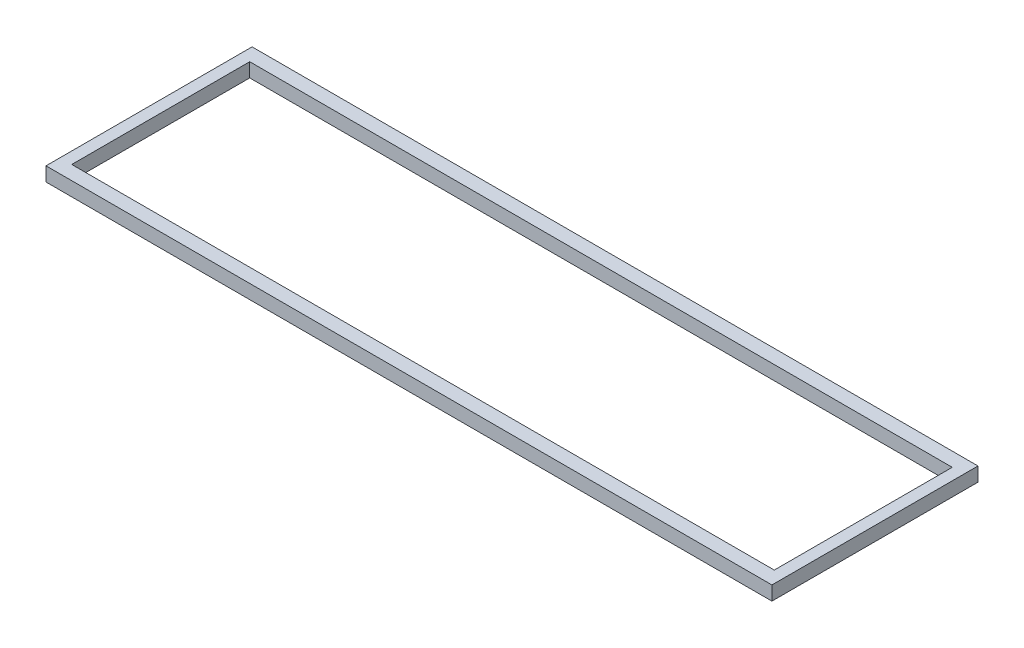
ISO-10303-21;
HEADER;
FILE_DESCRIPTION(('STEP AP214'),'2;1');
FILE_NAME('part.step','',(''),(''),'','','');
FILE_SCHEMA(('AUTOMOTIVE_DESIGN { 1 0 10303 214 1 1 1 1 }'));
ENDSEC;
DATA;
#1=APPLICATION_CONTEXT('core data for automotive mechanical design processes');
#2=APPLICATION_PROTOCOL_DEFINITION('international standard','automotive_design',2000,#1);
#3=PRODUCT_CONTEXT('',#1,'mechanical');
#4=PRODUCT('Part','Part','',(#3));
#5=PRODUCT_RELATED_PRODUCT_CATEGORY('part','',(#4));
#6=PRODUCT_DEFINITION_FORMATION('','',#4);
#7=PRODUCT_DEFINITION_CONTEXT('part definition',#1,'design');
#8=PRODUCT_DEFINITION('design','',#6,#7);
#9=PRODUCT_DEFINITION_SHAPE('','',#8);
#10=(LENGTH_UNIT() NAMED_UNIT(*) SI_UNIT(.MILLI.,.METRE.));
#11=(NAMED_UNIT(*) PLANE_ANGLE_UNIT() SI_UNIT($,.RADIAN.));
#12=(NAMED_UNIT(*) SI_UNIT($,.STERADIAN.) SOLID_ANGLE_UNIT());
#13=UNCERTAINTY_MEASURE_WITH_UNIT(LENGTH_MEASURE(1.E-05),#10,'distance_accuracy_value','');
#14=(GEOMETRIC_REPRESENTATION_CONTEXT(3) GLOBAL_UNCERTAINTY_ASSIGNED_CONTEXT((#13)) GLOBAL_UNIT_ASSIGNED_CONTEXT((#10,
#11,#12)) REPRESENTATION_CONTEXT('',''));
#15=CARTESIAN_POINT('',(0.,0.,0.));
#16=DIRECTION('',(0.,0.,1.));
#17=DIRECTION('',(1.,0.,0.));
#18=AXIS2_PLACEMENT_3D('',#15,#16,#17);
#19=CARTESIAN_POINT('',(0.,30.,0.));
#20=DIRECTION('',(0.,1.,0.));
#21=DIRECTION('',(0.,0.,1.));
#22=AXIS2_PLACEMENT_3D('',#19,#20,#21);
#23=PLANE('',#22);
#24=DIRECTION('',(0.,0.,1.));
#25=VECTOR('',#24,1.);
#26=CARTESIAN_POINT('',(-775.,30.,-341.424294268606));
#27=LINE('',#26,#25);
#28=CARTESIAN_POINT('',(-775.,30.,-341.424294268606));
#29=VERTEX_POINT('',#28);
#30=CARTESIAN_POINT('',(-775.,30.,98.5757057313944));
#31=VERTEX_POINT('',#30);
#32=EDGE_CURVE('E134',#29,#31,#27,.T.);
#33=ORIENTED_EDGE('',*,*,#32,.T.);
#34=DIRECTION('',(1.,0.,0.));
#35=VECTOR('',#34,1.);
#36=CARTESIAN_POINT('',(-775.,30.,98.5757057313944));
#37=LINE('',#36,#35);
#38=CARTESIAN_POINT('',(775.,30.,98.5757057313944));
#39=VERTEX_POINT('',#38);
#40=EDGE_CURVE('E137',#31,#39,#37,.T.);
#41=ORIENTED_EDGE('',*,*,#40,.T.);
#42=DIRECTION('',(0.,0.,-1.));
#43=VECTOR('',#42,1.);
#44=CARTESIAN_POINT('',(775.,30.,-341.424294268606));
#45=LINE('',#44,#43);
#46=CARTESIAN_POINT('',(775.,30.,-341.424294268606));
#47=VERTEX_POINT('',#46);
#48=EDGE_CURVE('E140',#39,#47,#45,.T.);
#49=ORIENTED_EDGE('',*,*,#48,.T.);
#50=DIRECTION('',(-1.,0.,0.));
#51=VECTOR('',#50,1.);
#52=CARTESIAN_POINT('',(-775.,30.,-341.424294268606));
#53=LINE('',#52,#51);
#54=EDGE_CURVE('E142',#47,#29,#53,.T.);
#55=ORIENTED_EDGE('',*,*,#54,.T.);
#56=EDGE_LOOP('',(#33,#41,#49,#55));
#57=FACE_BOUND('',#56,.T.);
#58=DIRECTION('',(1.,0.,0.));
#59=VECTOR('',#58,1.);
#60=CARTESIAN_POINT('',(-750.,30.,68.5757057313944));
#61=LINE('',#60,#59);
#62=CARTESIAN_POINT('',(-750.,30.,68.5757057313944));
#63=VERTEX_POINT('',#62);
#64=CARTESIAN_POINT('',(750.,30.,68.5757057313944));
#65=VERTEX_POINT('',#64);
#66=EDGE_CURVE('E106',#63,#65,#61,.T.);
#67=ORIENTED_EDGE('',*,*,#66,.F.);
#68=DIRECTION('',(0.,0.,1.));
#69=VECTOR('',#68,1.);
#70=CARTESIAN_POINT('',(-750.,30.,-311.424294268606));
#71=LINE('',#70,#69);
#72=CARTESIAN_POINT('',(-750.,30.,-311.424294268606));
#73=VERTEX_POINT('',#72);
#74=EDGE_CURVE('E98',#73,#63,#71,.T.);
#75=ORIENTED_EDGE('',*,*,#74,.F.);
#76=DIRECTION('',(-1.,0.,0.));
#77=VECTOR('',#76,1.);
#78=CARTESIAN_POINT('',(-750.,30.,-311.424294268606));
#79=LINE('',#78,#77);
#80=CARTESIAN_POINT('',(750.,30.,-311.424294268606));
#81=VERTEX_POINT('',#80);
#82=EDGE_CURVE('E120',#81,#73,#79,.T.);
#83=ORIENTED_EDGE('',*,*,#82,.F.);
#84=DIRECTION('',(0.,0.,-1.));
#85=VECTOR('',#84,1.);
#86=CARTESIAN_POINT('',(750.,30.,-311.424294268606));
#87=LINE('',#86,#85);
#88=EDGE_CURVE('E118',#65,#81,#87,.T.);
#89=ORIENTED_EDGE('',*,*,#88,.F.);
#90=EDGE_LOOP('',(#67,#75,#83,#89));
#91=FACE_BOUND('',#90,.T.);
#92=ADVANCED_FACE('F33',(#57,#91),#23,.T.);
#93=CARTESIAN_POINT('',(0.,0.,0.));
#94=DIRECTION('',(0.,1.,0.));
#95=DIRECTION('',(0.,0.,1.));
#96=AXIS2_PLACEMENT_3D('',#93,#94,#95);
#97=PLANE('',#96);
#98=DIRECTION('',(0.,0.,1.));
#99=VECTOR('',#98,1.);
#100=CARTESIAN_POINT('',(-775.,0.,-341.424294268606));
#101=LINE('',#100,#99);
#102=CARTESIAN_POINT('',(-775.,0.,-341.424294268606));
#103=VERTEX_POINT('',#102);
#104=CARTESIAN_POINT('',(-775.,0.,98.5757057313944));
#105=VERTEX_POINT('',#104);
#106=EDGE_CURVE('E114',#103,#105,#101,.T.);
#107=ORIENTED_EDGE('',*,*,#106,.F.);
#108=DIRECTION('',(-1.,0.,0.));
#109=VECTOR('',#108,1.);
#110=CARTESIAN_POINT('',(-775.,0.,-341.424294268606));
#111=LINE('',#110,#109);
#112=CARTESIAN_POINT('',(775.,0.,-341.424294268606));
#113=VERTEX_POINT('',#112);
#114=EDGE_CURVE('E138',#113,#103,#111,.T.);
#115=ORIENTED_EDGE('',*,*,#114,.F.);
#116=DIRECTION('',(0.,0.,-1.));
#117=VECTOR('',#116,1.);
#118=CARTESIAN_POINT('',(775.,0.,-341.424294268606));
#119=LINE('',#118,#117);
#120=CARTESIAN_POINT('',(775.,0.,98.5757057313944));
#121=VERTEX_POINT('',#120);
#122=EDGE_CURVE('E149',#121,#113,#119,.T.);
#123=ORIENTED_EDGE('',*,*,#122,.F.);
#124=DIRECTION('',(1.,0.,0.));
#125=VECTOR('',#124,1.);
#126=CARTESIAN_POINT('',(-775.,0.,98.5757057313944));
#127=LINE('',#126,#125);
#128=EDGE_CURVE('E147',#105,#121,#127,.T.);
#129=ORIENTED_EDGE('',*,*,#128,.F.);
#130=EDGE_LOOP('',(#107,#115,#123,#129));
#131=FACE_BOUND('',#130,.T.);
#132=DIRECTION('',(0.,0.,1.));
#133=VECTOR('',#132,1.);
#134=CARTESIAN_POINT('',(-750.,0.,-311.424294268606));
#135=LINE('',#134,#133);
#136=CARTESIAN_POINT('',(-750.,0.,-311.424294268606));
#137=VERTEX_POINT('',#136);
#138=CARTESIAN_POINT('',(-750.,0.,68.5757057313944));
#139=VERTEX_POINT('',#138);
#140=EDGE_CURVE('E56',#137,#139,#135,.T.);
#141=ORIENTED_EDGE('',*,*,#140,.T.);
#142=DIRECTION('',(1.,0.,0.));
#143=VECTOR('',#142,1.);
#144=CARTESIAN_POINT('',(-750.,0.,68.5757057313944));
#145=LINE('',#144,#143);
#146=CARTESIAN_POINT('',(750.,0.,68.5757057313944));
#147=VERTEX_POINT('',#146);
#148=EDGE_CURVE('E113',#139,#147,#145,.T.);
#149=ORIENTED_EDGE('',*,*,#148,.T.);
#150=DIRECTION('',(0.,0.,-1.));
#151=VECTOR('',#150,1.);
#152=CARTESIAN_POINT('',(750.,0.,-311.424294268606));
#153=LINE('',#152,#151);
#154=CARTESIAN_POINT('',(750.,0.,-311.424294268606));
#155=VERTEX_POINT('',#154);
#156=EDGE_CURVE('E126',#147,#155,#153,.T.);
#157=ORIENTED_EDGE('',*,*,#156,.T.);
#158=DIRECTION('',(-1.,0.,0.));
#159=VECTOR('',#158,1.);
#160=CARTESIAN_POINT('',(-750.,0.,-311.424294268606));
#161=LINE('',#160,#159);
#162=EDGE_CURVE('E107',#155,#137,#161,.T.);
#163=ORIENTED_EDGE('',*,*,#162,.T.);
#164=EDGE_LOOP('',(#141,#149,#157,#163));
#165=FACE_BOUND('',#164,.T.);
#166=ADVANCED_FACE('F167',(#131,#165),#97,.F.);
#167=CARTESIAN_POINT('',(-775.,30.,-341.424294268606));
#168=DIRECTION('',(1.,0.,0.));
#169=DIRECTION('',(0.,0.,-1.));
#170=AXIS2_PLACEMENT_3D('',#167,#168,#169);
#171=PLANE('',#170);
#172=ORIENTED_EDGE('',*,*,#106,.T.);
#173=DIRECTION('',(0.,-1.,0.));
#174=VECTOR('',#173,1.);
#175=CARTESIAN_POINT('',(-775.,30.,98.5757057313944));
#176=LINE('',#175,#174);
#177=EDGE_CURVE('E11',#31,#105,#176,.T.);
#178=ORIENTED_EDGE('',*,*,#177,.F.);
#179=ORIENTED_EDGE('',*,*,#32,.F.);
#180=DIRECTION('',(0.,-1.,0.));
#181=VECTOR('',#180,1.);
#182=CARTESIAN_POINT('',(-775.,30.,-341.424294268606));
#183=LINE('',#182,#181);
#184=EDGE_CURVE('E144',#29,#103,#183,.T.);
#185=ORIENTED_EDGE('',*,*,#184,.T.);
#186=EDGE_LOOP('',(#172,#178,#179,#185));
#187=FACE_BOUND('',#186,.T.);
#188=ADVANCED_FACE('F35',(#187),#171,.F.);
#189=CARTESIAN_POINT('',(-775.,30.,98.5757057313944));
#190=DIRECTION('',(0.,0.,-1.));
#191=DIRECTION('',(-1.,0.,0.));
#192=AXIS2_PLACEMENT_3D('',#189,#190,#191);
#193=PLANE('',#192);
#194=ORIENTED_EDGE('',*,*,#128,.T.);
#195=DIRECTION('',(0.,-1.,0.));
#196=VECTOR('',#195,1.);
#197=CARTESIAN_POINT('',(775.,30.,98.5757057313944));
#198=LINE('',#197,#196);
#199=EDGE_CURVE('E41',#39,#121,#198,.T.);
#200=ORIENTED_EDGE('',*,*,#199,.F.);
#201=ORIENTED_EDGE('',*,*,#40,.F.);
#202=ORIENTED_EDGE('',*,*,#177,.T.);
#203=EDGE_LOOP('',(#194,#200,#201,#202));
#204=FACE_BOUND('',#203,.T.);
#205=ADVANCED_FACE('F177',(#204),#193,.F.);
#206=CARTESIAN_POINT('',(775.,30.,-341.424294268606));
#207=DIRECTION('',(-1.,0.,0.));
#208=DIRECTION('',(0.,0.,1.));
#209=AXIS2_PLACEMENT_3D('',#206,#207,#208);
#210=PLANE('',#209);
#211=ORIENTED_EDGE('',*,*,#122,.T.);
#212=DIRECTION('',(0.,-1.,0.));
#213=VECTOR('',#212,1.);
#214=CARTESIAN_POINT('',(775.,30.,-341.424294268606));
#215=LINE('',#214,#213);
#216=EDGE_CURVE('E154',#47,#113,#215,.T.);
#217=ORIENTED_EDGE('',*,*,#216,.F.);
#218=ORIENTED_EDGE('',*,*,#48,.F.);
#219=ORIENTED_EDGE('',*,*,#199,.T.);
#220=EDGE_LOOP('',(#211,#217,#218,#219));
#221=FACE_BOUND('',#220,.T.);
#222=ADVANCED_FACE('F161',(#221),#210,.F.);
#223=CARTESIAN_POINT('',(-775.,30.,-341.424294268606));
#224=DIRECTION('',(0.,0.,1.));
#225=DIRECTION('',(1.,0.,0.));
#226=AXIS2_PLACEMENT_3D('',#223,#224,#225);
#227=PLANE('',#226);
#228=ORIENTED_EDGE('',*,*,#114,.T.);
#229=ORIENTED_EDGE('',*,*,#184,.F.);
#230=ORIENTED_EDGE('',*,*,#54,.F.);
#231=ORIENTED_EDGE('',*,*,#216,.T.);
#232=EDGE_LOOP('',(#228,#229,#230,#231));
#233=FACE_BOUND('',#232,.T.);
#234=ADVANCED_FACE('F171',(#233),#227,.F.);
#235=CARTESIAN_POINT('',(-750.,30.,-311.424294268606));
#236=DIRECTION('',(1.,0.,0.));
#237=DIRECTION('',(0.,0.,-1.));
#238=AXIS2_PLACEMENT_3D('',#235,#236,#237);
#239=PLANE('',#238);
#240=ORIENTED_EDGE('',*,*,#140,.F.);
#241=DIRECTION('',(0.,-1.,0.));
#242=VECTOR('',#241,1.);
#243=CARTESIAN_POINT('',(-750.,30.,-311.424294268606));
#244=LINE('',#243,#242);
#245=EDGE_CURVE('E102',#73,#137,#244,.T.);
#246=ORIENTED_EDGE('',*,*,#245,.F.);
#247=ORIENTED_EDGE('',*,*,#74,.T.);
#248=DIRECTION('',(0.,-1.,0.));
#249=VECTOR('',#248,1.);
#250=CARTESIAN_POINT('',(-750.,30.,68.5757057313944));
#251=LINE('',#250,#249);
#252=EDGE_CURVE('E101',#63,#139,#251,.T.);
#253=ORIENTED_EDGE('',*,*,#252,.T.);
#254=EDGE_LOOP('',(#240,#246,#247,#253));
#255=FACE_BOUND('',#254,.T.);
#256=ADVANCED_FACE('F100',(#255),#239,.T.);
#257=CARTESIAN_POINT('',(-750.,30.,68.5757057313944));
#258=DIRECTION('',(0.,0.,-1.));
#259=DIRECTION('',(-1.,0.,0.));
#260=AXIS2_PLACEMENT_3D('',#257,#258,#259);
#261=PLANE('',#260);
#262=ORIENTED_EDGE('',*,*,#148,.F.);
#263=ORIENTED_EDGE('',*,*,#252,.F.);
#264=ORIENTED_EDGE('',*,*,#66,.T.);
#265=DIRECTION('',(0.,-1.,0.));
#266=VECTOR('',#265,1.);
#267=CARTESIAN_POINT('',(750.,30.,68.5757057313944));
#268=LINE('',#267,#266);
#269=EDGE_CURVE('E115',#65,#147,#268,.T.);
#270=ORIENTED_EDGE('',*,*,#269,.T.);
#271=EDGE_LOOP('',(#262,#263,#264,#270));
#272=FACE_BOUND('',#271,.T.);
#273=ADVANCED_FACE('F110',(#272),#261,.T.);
#274=CARTESIAN_POINT('',(750.,30.,-311.424294268606));
#275=DIRECTION('',(-1.,0.,0.));
#276=DIRECTION('',(0.,0.,1.));
#277=AXIS2_PLACEMENT_3D('',#274,#275,#276);
#278=PLANE('',#277);
#279=ORIENTED_EDGE('',*,*,#156,.F.);
#280=ORIENTED_EDGE('',*,*,#269,.F.);
#281=ORIENTED_EDGE('',*,*,#88,.T.);
#282=DIRECTION('',(0.,-1.,0.));
#283=VECTOR('',#282,1.);
#284=CARTESIAN_POINT('',(750.,30.,-311.424294268606));
#285=LINE('',#284,#283);
#286=EDGE_CURVE('E48',#81,#155,#285,.T.);
#287=ORIENTED_EDGE('',*,*,#286,.T.);
#288=EDGE_LOOP('',(#279,#280,#281,#287));
#289=FACE_BOUND('',#288,.T.);
#290=ADVANCED_FACE('F200',(#289),#278,.T.);
#291=CARTESIAN_POINT('',(-750.,30.,-311.424294268606));
#292=DIRECTION('',(0.,0.,1.));
#293=DIRECTION('',(1.,0.,0.));
#294=AXIS2_PLACEMENT_3D('',#291,#292,#293);
#295=PLANE('',#294);
#296=ORIENTED_EDGE('',*,*,#162,.F.);
#297=ORIENTED_EDGE('',*,*,#286,.F.);
#298=ORIENTED_EDGE('',*,*,#82,.T.);
#299=ORIENTED_EDGE('',*,*,#245,.T.);
#300=EDGE_LOOP('',(#296,#297,#298,#299));
#301=FACE_BOUND('',#300,.T.);
#302=ADVANCED_FACE('F204',(#301),#295,.T.);
#303=CLOSED_SHELL('',(#92,#166,#188,#205,#222,#234,#256,#273,#290,#302));
#304=MANIFOLD_SOLID_BREP('B2',#303);
#305=ADVANCED_BREP_SHAPE_REPRESENTATION('',(#18,#304),#14);
#306=SHAPE_DEFINITION_REPRESENTATION(#9,#305);
ENDSEC;
END-ISO-10303-21;
